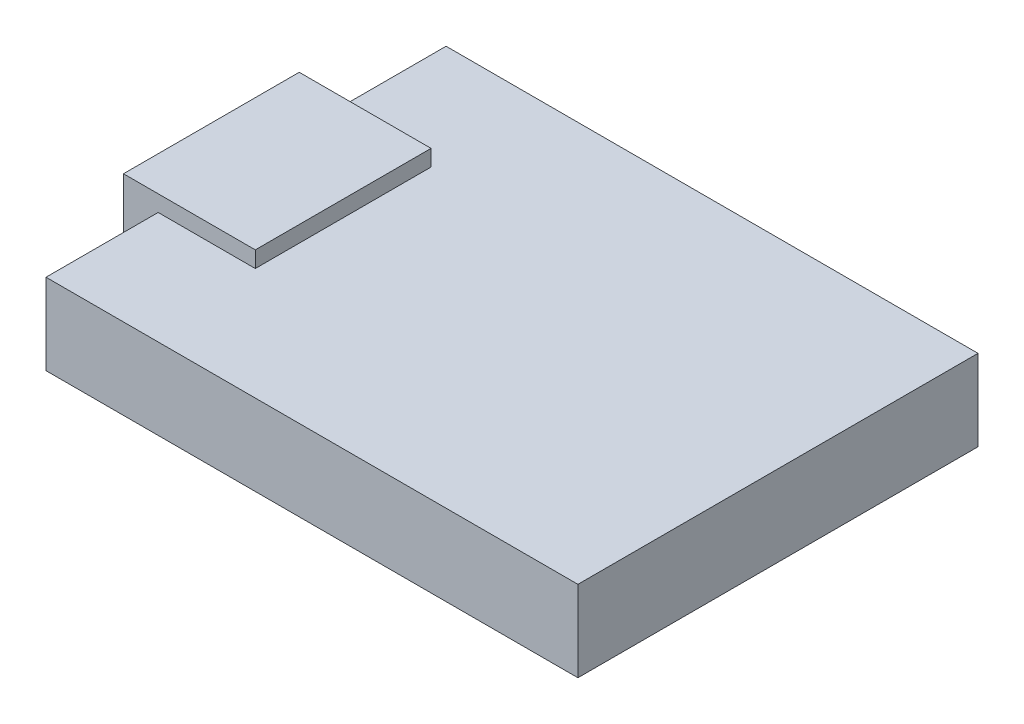
ISO-10303-21;
HEADER;
FILE_DESCRIPTION(('STEP AP214'),'2;1');
FILE_NAME('part.step','',(''),(''),'','','');
FILE_SCHEMA(('AUTOMOTIVE_DESIGN { 1 0 10303 214 1 1 1 1 }'));
ENDSEC;
DATA;
#1=APPLICATION_CONTEXT('core data for automotive mechanical design processes');
#2=APPLICATION_PROTOCOL_DEFINITION('international standard','automotive_design',2000,#1);
#3=PRODUCT_CONTEXT('',#1,'mechanical');
#4=PRODUCT('Part','Part','',(#3));
#5=PRODUCT_RELATED_PRODUCT_CATEGORY('part','',(#4));
#6=PRODUCT_DEFINITION_FORMATION('','',#4);
#7=PRODUCT_DEFINITION_CONTEXT('part definition',#1,'design');
#8=PRODUCT_DEFINITION('design','',#6,#7);
#9=PRODUCT_DEFINITION_SHAPE('','',#8);
#10=(LENGTH_UNIT() NAMED_UNIT(*) SI_UNIT(.MILLI.,.METRE.));
#11=(NAMED_UNIT(*) PLANE_ANGLE_UNIT() SI_UNIT($,.RADIAN.));
#12=(NAMED_UNIT(*) SI_UNIT($,.STERADIAN.) SOLID_ANGLE_UNIT());
#13=UNCERTAINTY_MEASURE_WITH_UNIT(LENGTH_MEASURE(1.E-05),#10,'distance_accuracy_value','');
#14=(GEOMETRIC_REPRESENTATION_CONTEXT(3) GLOBAL_UNCERTAINTY_ASSIGNED_CONTEXT((#13)) GLOBAL_UNIT_ASSIGNED_CONTEXT((#10,
#11,#12)) REPRESENTATION_CONTEXT('',''));
#15=CARTESIAN_POINT('',(0.,0.,0.));
#16=DIRECTION('',(0.,0.,1.));
#17=DIRECTION('',(1.,0.,0.));
#18=AXIS2_PLACEMENT_3D('',#15,#16,#17);
#19=CARTESIAN_POINT('',(-11.5,3.5,-8.65));
#20=DIRECTION('',(1.,0.,0.));
#21=DIRECTION('',(0.,0.,-1.));
#22=AXIS2_PLACEMENT_3D('',#19,#20,#21);
#23=PLANE('',#22);
#24=DIRECTION('',(0.,1.,0.));
#25=VECTOR('',#24,1.);
#26=CARTESIAN_POINT('',(-11.5,1.6,-3.8));
#27=LINE('',#26,#25);
#28=CARTESIAN_POINT('',(-11.5,1.6,-3.8));
#29=VERTEX_POINT('',#28);
#30=CARTESIAN_POINT('',(-11.5,3.5,-3.8));
#31=VERTEX_POINT('',#30);
#32=EDGE_CURVE('E130',#29,#31,#27,.T.);
#33=ORIENTED_EDGE('',*,*,#32,.T.);
#34=DIRECTION('',(0.,0.,1.));
#35=VECTOR('',#34,1.);
#36=CARTESIAN_POINT('',(-11.5,3.5,-8.65));
#37=LINE('',#36,#35);
#38=CARTESIAN_POINT('',(-11.5,3.5,-8.65));
#39=VERTEX_POINT('',#38);
#40=EDGE_CURVE('E161',#39,#31,#37,.T.);
#41=ORIENTED_EDGE('',*,*,#40,.F.);
#42=DIRECTION('',(0.,-1.,0.));
#43=VECTOR('',#42,1.);
#44=CARTESIAN_POINT('',(-11.5,3.5,-8.65));
#45=LINE('',#44,#43);
#46=CARTESIAN_POINT('',(-11.5,0.,-8.65));
#47=VERTEX_POINT('',#46);
#48=EDGE_CURVE('E170',#39,#47,#45,.T.);
#49=ORIENTED_EDGE('',*,*,#48,.T.);
#50=DIRECTION('',(0.,0.,1.));
#51=VECTOR('',#50,1.);
#52=CARTESIAN_POINT('',(-11.5,0.,-8.65));
#53=LINE('',#52,#51);
#54=CARTESIAN_POINT('',(-11.5,0.,8.65));
#55=VERTEX_POINT('',#54);
#56=EDGE_CURVE('E124',#47,#55,#53,.T.);
#57=ORIENTED_EDGE('',*,*,#56,.T.);
#58=DIRECTION('',(0.,-1.,0.));
#59=VECTOR('',#58,1.);
#60=CARTESIAN_POINT('',(-11.5,3.5,8.65));
#61=LINE('',#60,#59);
#62=CARTESIAN_POINT('',(-11.5,3.5,8.65));
#63=VERTEX_POINT('',#62);
#64=EDGE_CURVE('E38',#63,#55,#61,.T.);
#65=ORIENTED_EDGE('',*,*,#64,.F.);
#66=CARTESIAN_POINT('',(-11.5,3.5,3.8));
#67=VERTEX_POINT('',#66);
#68=EDGE_CURVE('E164',#67,#63,#37,.T.);
#69=ORIENTED_EDGE('',*,*,#68,.F.);
#70=DIRECTION('',(0.,1.,0.));
#71=VECTOR('',#70,1.);
#72=CARTESIAN_POINT('',(-11.5,1.6,3.8));
#73=LINE('',#72,#71);
#74=CARTESIAN_POINT('',(-11.5,1.6,3.8));
#75=VERTEX_POINT('',#74);
#76=EDGE_CURVE('E57',#75,#67,#73,.T.);
#77=ORIENTED_EDGE('',*,*,#76,.F.);
#78=DIRECTION('',(0.,0.,1.));
#79=VECTOR('',#78,1.);
#80=CARTESIAN_POINT('',(-11.5,1.6,-3.8));
#81=LINE('',#80,#79);
#82=EDGE_CURVE('E133',#29,#75,#81,.T.);
#83=ORIENTED_EDGE('',*,*,#82,.F.);
#84=EDGE_LOOP('',(#33,#41,#49,#57,#65,#69,#77,#83));
#85=FACE_BOUND('',#84,.T.);
#86=ADVANCED_FACE('F35',(#85),#23,.F.);
#87=CARTESIAN_POINT('',(-11.5,3.5,8.65));
#88=DIRECTION('',(0.,0.,-1.));
#89=DIRECTION('',(-1.,0.,0.));
#90=AXIS2_PLACEMENT_3D('',#87,#88,#89);
#91=PLANE('',#90);
#92=DIRECTION('',(1.,0.,0.));
#93=VECTOR('',#92,1.);
#94=CARTESIAN_POINT('',(-11.5,0.,8.65));
#95=LINE('',#94,#93);
#96=CARTESIAN_POINT('',(11.5,0.,8.65));
#97=VERTEX_POINT('',#96);
#98=EDGE_CURVE('E173',#55,#97,#95,.T.);
#99=ORIENTED_EDGE('',*,*,#98,.T.);
#100=DIRECTION('',(0.,-1.,0.));
#101=VECTOR('',#100,1.);
#102=CARTESIAN_POINT('',(11.5,3.5,8.65));
#103=LINE('',#102,#101);
#104=CARTESIAN_POINT('',(11.5,3.5,8.65));
#105=VERTEX_POINT('',#104);
#106=EDGE_CURVE('E183',#105,#97,#103,.T.);
#107=ORIENTED_EDGE('',*,*,#106,.F.);
#108=DIRECTION('',(1.,0.,0.));
#109=VECTOR('',#108,1.);
#110=CARTESIAN_POINT('',(-11.5,3.5,8.65));
#111=LINE('',#110,#109);
#112=EDGE_CURVE('E163',#63,#105,#111,.T.);
#113=ORIENTED_EDGE('',*,*,#112,.F.);
#114=ORIENTED_EDGE('',*,*,#64,.T.);
#115=EDGE_LOOP('',(#99,#107,#113,#114));
#116=FACE_BOUND('',#115,.T.);
#117=ADVANCED_FACE('F193',(#116),#91,.F.);
#118=CARTESIAN_POINT('',(11.5,3.5,-8.65));
#119=DIRECTION('',(-1.,0.,0.));
#120=DIRECTION('',(0.,0.,1.));
#121=AXIS2_PLACEMENT_3D('',#118,#119,#120);
#122=PLANE('',#121);
#123=DIRECTION('',(0.,0.,-1.));
#124=VECTOR('',#123,1.);
#125=CARTESIAN_POINT('',(11.5,0.,-8.65));
#126=LINE('',#125,#124);
#127=CARTESIAN_POINT('',(11.5,0.,-8.65));
#128=VERTEX_POINT('',#127);
#129=EDGE_CURVE('E175',#97,#128,#126,.T.);
#130=ORIENTED_EDGE('',*,*,#129,.T.);
#131=DIRECTION('',(0.,-1.,0.));
#132=VECTOR('',#131,1.);
#133=CARTESIAN_POINT('',(11.5,3.5,-8.65));
#134=LINE('',#133,#132);
#135=CARTESIAN_POINT('',(11.5,3.5,-8.65));
#136=VERTEX_POINT('',#135);
#137=EDGE_CURVE('E181',#136,#128,#134,.T.);
#138=ORIENTED_EDGE('',*,*,#137,.F.);
#139=DIRECTION('',(0.,0.,-1.));
#140=VECTOR('',#139,1.);
#141=CARTESIAN_POINT('',(11.5,3.5,-8.65));
#142=LINE('',#141,#140);
#143=EDGE_CURVE('E166',#105,#136,#142,.T.);
#144=ORIENTED_EDGE('',*,*,#143,.F.);
#145=ORIENTED_EDGE('',*,*,#106,.T.);
#146=EDGE_LOOP('',(#130,#138,#144,#145));
#147=FACE_BOUND('',#146,.T.);
#148=ADVANCED_FACE('F203',(#147),#122,.F.);
#149=CARTESIAN_POINT('',(-11.5,3.5,-8.65));
#150=DIRECTION('',(0.,0.,1.));
#151=DIRECTION('',(1.,0.,0.));
#152=AXIS2_PLACEMENT_3D('',#149,#150,#151);
#153=PLANE('',#152);
#154=DIRECTION('',(-1.,0.,0.));
#155=VECTOR('',#154,1.);
#156=CARTESIAN_POINT('',(-11.5,0.,-8.65));
#157=LINE('',#156,#155);
#158=EDGE_CURVE('E177',#128,#47,#157,.T.);
#159=ORIENTED_EDGE('',*,*,#158,.T.);
#160=ORIENTED_EDGE('',*,*,#48,.F.);
#161=DIRECTION('',(-1.,0.,0.));
#162=VECTOR('',#161,1.);
#163=CARTESIAN_POINT('',(-11.5,3.5,-8.65));
#164=LINE('',#163,#162);
#165=EDGE_CURVE('E168',#136,#39,#164,.T.);
#166=ORIENTED_EDGE('',*,*,#165,.F.);
#167=ORIENTED_EDGE('',*,*,#137,.T.);
#168=EDGE_LOOP('',(#159,#160,#166,#167));
#169=FACE_BOUND('',#168,.T.);
#170=ADVANCED_FACE('F206',(#169),#153,.F.);
#171=CARTESIAN_POINT('',(0.,3.5,0.));
#172=DIRECTION('',(0.,1.,0.));
#173=DIRECTION('',(0.,0.,1.));
#174=AXIS2_PLACEMENT_3D('',#171,#172,#173);
#175=PLANE('',#174);
#176=DIRECTION('',(-1.,0.,0.));
#177=VECTOR('',#176,1.);
#178=CARTESIAN_POINT('',(-7.29994910288201,3.5,-3.8));
#179=LINE('',#178,#177);
#180=CARTESIAN_POINT('',(-7.29994910288201,3.5,-3.8));
#181=VERTEX_POINT('',#180);
#182=EDGE_CURVE('E50',#181,#31,#179,.T.);
#183=ORIENTED_EDGE('',*,*,#182,.F.);
#184=DIRECTION('',(0.,0.,-1.));
#185=VECTOR('',#184,1.);
#186=CARTESIAN_POINT('',(-7.29994910288201,3.5,-3.8));
#187=LINE('',#186,#185);
#188=CARTESIAN_POINT('',(-7.29994910288201,3.5,3.8));
#189=VERTEX_POINT('',#188);
#190=EDGE_CURVE('E146',#189,#181,#187,.T.);
#191=ORIENTED_EDGE('',*,*,#190,.F.);
#192=DIRECTION('',(1.,0.,0.));
#193=VECTOR('',#192,1.);
#194=CARTESIAN_POINT('',(-7.29994910288201,3.5,3.8));
#195=LINE('',#194,#193);
#196=EDGE_CURVE('E11',#67,#189,#195,.T.);
#197=ORIENTED_EDGE('',*,*,#196,.F.);
#198=ORIENTED_EDGE('',*,*,#68,.T.);
#199=ORIENTED_EDGE('',*,*,#112,.T.);
#200=ORIENTED_EDGE('',*,*,#143,.T.);
#201=ORIENTED_EDGE('',*,*,#165,.T.);
#202=ORIENTED_EDGE('',*,*,#40,.T.);
#203=EDGE_LOOP('',(#183,#191,#197,#198,#199,#200,#201,#202));
#204=FACE_BOUND('',#203,.T.);
#205=ADVANCED_FACE('F207',(#204),#175,.T.);
#206=CARTESIAN_POINT('',(0.,0.,0.));
#207=DIRECTION('',(0.,1.,0.));
#208=DIRECTION('',(0.,0.,1.));
#209=AXIS2_PLACEMENT_3D('',#206,#207,#208);
#210=PLANE('',#209);
#211=ORIENTED_EDGE('',*,*,#56,.F.);
#212=ORIENTED_EDGE('',*,*,#158,.F.);
#213=ORIENTED_EDGE('',*,*,#129,.F.);
#214=ORIENTED_EDGE('',*,*,#98,.F.);
#215=EDGE_LOOP('',(#211,#212,#213,#214));
#216=FACE_BOUND('',#215,.T.);
#217=ADVANCED_FACE('F201',(#216),#210,.F.);
#218=CARTESIAN_POINT('',(-7.29994910288201,4.2,-3.8));
#219=DIRECTION('',(0.,0.,1.));
#220=DIRECTION('',(1.,0.,0.));
#221=AXIS2_PLACEMENT_3D('',#218,#219,#220);
#222=PLANE('',#221);
#223=ORIENTED_EDGE('',*,*,#182,.T.);
#224=ORIENTED_EDGE('',*,*,#32,.F.);
#225=DIRECTION('',(1.,0.,0.));
#226=VECTOR('',#225,1.);
#227=CARTESIAN_POINT('',(-13.000050897118,1.6,-3.8));
#228=LINE('',#227,#226);
#229=CARTESIAN_POINT('',(-13.000050897118,1.6,-3.8));
#230=VERTEX_POINT('',#229);
#231=EDGE_CURVE('E128',#230,#29,#228,.T.);
#232=ORIENTED_EDGE('',*,*,#231,.F.);
#233=DIRECTION('',(0.,-1.,0.));
#234=VECTOR('',#233,1.);
#235=CARTESIAN_POINT('',(-13.000050897118,4.2,-3.8));
#236=LINE('',#235,#234);
#237=CARTESIAN_POINT('',(-13.000050897118,4.2,-3.8));
#238=VERTEX_POINT('',#237);
#239=EDGE_CURVE('E114',#238,#230,#236,.T.);
#240=ORIENTED_EDGE('',*,*,#239,.F.);
#241=DIRECTION('',(-1.,0.,0.));
#242=VECTOR('',#241,1.);
#243=CARTESIAN_POINT('',(-7.29994910288201,4.2,-3.8));
#244=LINE('',#243,#242);
#245=CARTESIAN_POINT('',(-7.29994910288201,4.2,-3.8));
#246=VERTEX_POINT('',#245);
#247=EDGE_CURVE('E144',#246,#238,#244,.T.);
#248=ORIENTED_EDGE('',*,*,#247,.F.);
#249=DIRECTION('',(0.,-1.,0.));
#250=VECTOR('',#249,1.);
#251=CARTESIAN_POINT('',(-7.29994910288201,4.2,-3.8));
#252=LINE('',#251,#250);
#253=EDGE_CURVE('E152',#246,#181,#252,.T.);
#254=ORIENTED_EDGE('',*,*,#253,.T.);
#255=EDGE_LOOP('',(#223,#224,#232,#240,#248,#254));
#256=FACE_BOUND('',#255,.T.);
#257=ADVANCED_FACE('F129',(#256),#222,.F.);
#258=CARTESIAN_POINT('',(-13.000050897118,4.2,-3.8));
#259=DIRECTION('',(1.,0.,0.));
#260=DIRECTION('',(0.,0.,-1.));
#261=AXIS2_PLACEMENT_3D('',#258,#259,#260);
#262=PLANE('',#261);
#263=ORIENTED_EDGE('',*,*,#239,.T.);
#264=DIRECTION('',(0.,0.,-1.));
#265=VECTOR('',#264,1.);
#266=CARTESIAN_POINT('',(-13.000050897118,1.6,-3.8));
#267=LINE('',#266,#265);
#268=CARTESIAN_POINT('',(-13.000050897118,1.6,3.8));
#269=VERTEX_POINT('',#268);
#270=EDGE_CURVE('E119',#269,#230,#267,.T.);
#271=ORIENTED_EDGE('',*,*,#270,.F.);
#272=DIRECTION('',(0.,-1.,0.));
#273=VECTOR('',#272,1.);
#274=CARTESIAN_POINT('',(-13.000050897118,4.2,3.8));
#275=LINE('',#274,#273);
#276=CARTESIAN_POINT('',(-13.000050897118,4.2,3.8));
#277=VERTEX_POINT('',#276);
#278=EDGE_CURVE('E125',#277,#269,#275,.T.);
#279=ORIENTED_EDGE('',*,*,#278,.F.);
#280=DIRECTION('',(0.,0.,1.));
#281=VECTOR('',#280,1.);
#282=CARTESIAN_POINT('',(-13.000050897118,4.2,-3.8));
#283=LINE('',#282,#281);
#284=EDGE_CURVE('E120',#238,#277,#283,.T.);
#285=ORIENTED_EDGE('',*,*,#284,.F.);
#286=EDGE_LOOP('',(#263,#271,#279,#285));
#287=FACE_BOUND('',#286,.T.);
#288=ADVANCED_FACE('F116',(#287),#262,.F.);
#289=CARTESIAN_POINT('',(-7.29994910288201,4.2,3.8));
#290=DIRECTION('',(0.,0.,-1.));
#291=DIRECTION('',(-1.,0.,0.));
#292=AXIS2_PLACEMENT_3D('',#289,#290,#291);
#293=PLANE('',#292);
#294=ORIENTED_EDGE('',*,*,#278,.T.);
#295=DIRECTION('',(-1.,0.,0.));
#296=VECTOR('',#295,1.);
#297=CARTESIAN_POINT('',(-13.000050897118,1.6,3.8));
#298=LINE('',#297,#296);
#299=EDGE_CURVE('E137',#75,#269,#298,.T.);
#300=ORIENTED_EDGE('',*,*,#299,.F.);
#301=ORIENTED_EDGE('',*,*,#76,.T.);
#302=ORIENTED_EDGE('',*,*,#196,.T.);
#303=DIRECTION('',(0.,-1.,0.));
#304=VECTOR('',#303,1.);
#305=CARTESIAN_POINT('',(-7.29994910288201,4.2,3.8));
#306=LINE('',#305,#304);
#307=CARTESIAN_POINT('',(-7.29994910288201,4.2,3.8));
#308=VERTEX_POINT('',#307);
#309=EDGE_CURVE('E157',#308,#189,#306,.T.);
#310=ORIENTED_EDGE('',*,*,#309,.F.);
#311=DIRECTION('',(1.,0.,0.));
#312=VECTOR('',#311,1.);
#313=CARTESIAN_POINT('',(-7.29994910288201,4.2,3.8));
#314=LINE('',#313,#312);
#315=EDGE_CURVE('E148',#277,#308,#314,.T.);
#316=ORIENTED_EDGE('',*,*,#315,.F.);
#317=EDGE_LOOP('',(#294,#300,#301,#302,#310,#316));
#318=FACE_BOUND('',#317,.T.);
#319=ADVANCED_FACE('F208',(#318),#293,.F.);
#320=CARTESIAN_POINT('',(-7.29994910288201,4.2,-3.8));
#321=DIRECTION('',(-1.,0.,0.));
#322=DIRECTION('',(0.,0.,1.));
#323=AXIS2_PLACEMENT_3D('',#320,#321,#322);
#324=PLANE('',#323);
#325=ORIENTED_EDGE('',*,*,#190,.T.);
#326=ORIENTED_EDGE('',*,*,#253,.F.);
#327=DIRECTION('',(0.,0.,-1.));
#328=VECTOR('',#327,1.);
#329=CARTESIAN_POINT('',(-7.29994910288201,4.2,-3.8));
#330=LINE('',#329,#328);
#331=EDGE_CURVE('E150',#308,#246,#330,.T.);
#332=ORIENTED_EDGE('',*,*,#331,.F.);
#333=ORIENTED_EDGE('',*,*,#309,.T.);
#334=EDGE_LOOP('',(#325,#326,#332,#333));
#335=FACE_BOUND('',#334,.T.);
#336=ADVANCED_FACE('F216',(#335),#324,.F.);
#337=CARTESIAN_POINT('',(0.,4.2,0.));
#338=DIRECTION('',(0.,1.,0.));
#339=DIRECTION('',(0.,0.,1.));
#340=AXIS2_PLACEMENT_3D('',#337,#338,#339);
#341=PLANE('',#340);
#342=ORIENTED_EDGE('',*,*,#247,.T.);
#343=ORIENTED_EDGE('',*,*,#284,.T.);
#344=ORIENTED_EDGE('',*,*,#315,.T.);
#345=ORIENTED_EDGE('',*,*,#331,.T.);
#346=EDGE_LOOP('',(#342,#343,#344,#345));
#347=FACE_BOUND('',#346,.T.);
#348=ADVANCED_FACE('F213',(#347),#341,.T.);
#349=CARTESIAN_POINT('',(0.,1.6,0.));
#350=DIRECTION('',(0.,1.,0.));
#351=DIRECTION('',(0.,0.,1.));
#352=AXIS2_PLACEMENT_3D('',#349,#350,#351);
#353=PLANE('',#352);
#354=ORIENTED_EDGE('',*,*,#270,.T.);
#355=ORIENTED_EDGE('',*,*,#231,.T.);
#356=ORIENTED_EDGE('',*,*,#82,.T.);
#357=ORIENTED_EDGE('',*,*,#299,.T.);
#358=EDGE_LOOP('',(#354,#355,#356,#357));
#359=FACE_BOUND('',#358,.T.);
#360=ADVANCED_FACE('F136',(#359),#353,.F.);
#361=CLOSED_SHELL('',(#86,#117,#148,#170,#205,#217,#257,#288,#319,#336,#348,#360));
#362=MANIFOLD_SOLID_BREP('B2',#361);
#363=ADVANCED_BREP_SHAPE_REPRESENTATION('',(#18,#362),#14);
#364=SHAPE_DEFINITION_REPRESENTATION(#9,#363);
ENDSEC;
END-ISO-10303-21;
